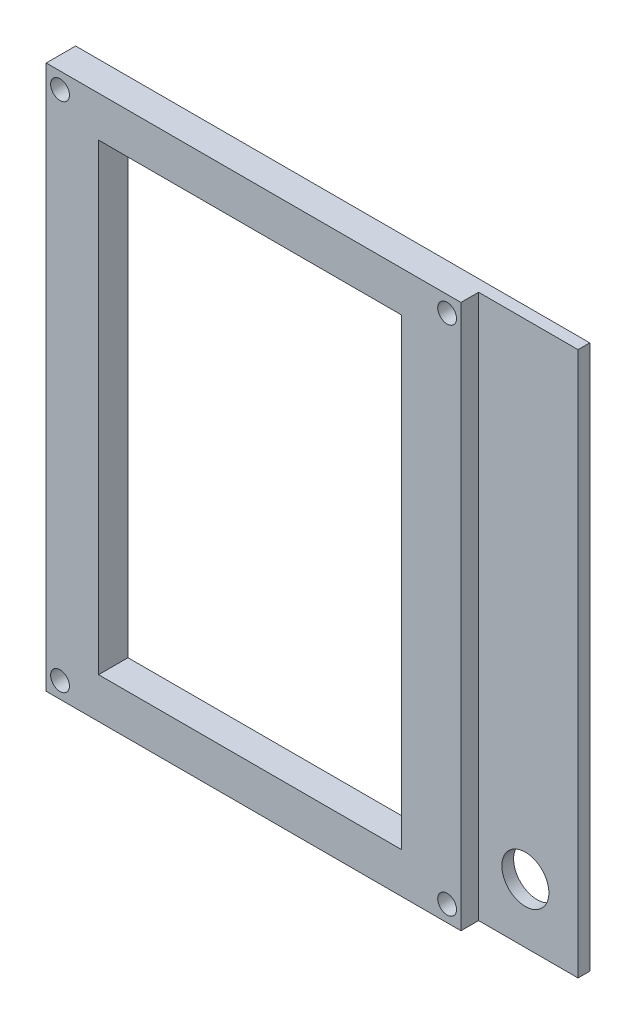
ISO-10303-21;
HEADER;
FILE_DESCRIPTION(('STEP AP214'),'2;1');
FILE_NAME('part.step','',(''),(''),'','','');
FILE_SCHEMA(('AUTOMOTIVE_DESIGN { 1 0 10303 214 1 1 1 1 }'));
ENDSEC;
DATA;
#1=APPLICATION_CONTEXT('core data for automotive mechanical design processes');
#2=APPLICATION_PROTOCOL_DEFINITION('international standard','automotive_design',2000,#1);
#3=PRODUCT_CONTEXT('',#1,'mechanical');
#4=PRODUCT('Part','Part','',(#3));
#5=PRODUCT_RELATED_PRODUCT_CATEGORY('part','',(#4));
#6=PRODUCT_DEFINITION_FORMATION('','',#4);
#7=PRODUCT_DEFINITION_CONTEXT('part definition',#1,'design');
#8=PRODUCT_DEFINITION('design','',#6,#7);
#9=PRODUCT_DEFINITION_SHAPE('','',#8);
#10=(LENGTH_UNIT() NAMED_UNIT(*) SI_UNIT(.MILLI.,.METRE.));
#11=(NAMED_UNIT(*) PLANE_ANGLE_UNIT() SI_UNIT($,.RADIAN.));
#12=(NAMED_UNIT(*) SI_UNIT($,.STERADIAN.) SOLID_ANGLE_UNIT());
#13=UNCERTAINTY_MEASURE_WITH_UNIT(LENGTH_MEASURE(1.E-05),#10,'distance_accuracy_value','');
#14=(GEOMETRIC_REPRESENTATION_CONTEXT(3) GLOBAL_UNCERTAINTY_ASSIGNED_CONTEXT((#13)) GLOBAL_UNIT_ASSIGNED_CONTEXT((#10,
#11,#12)) REPRESENTATION_CONTEXT('',''));
#15=CARTESIAN_POINT('',(0.,0.,0.));
#16=DIRECTION('',(0.,0.,1.));
#17=DIRECTION('',(1.,0.,0.));
#18=AXIS2_PLACEMENT_3D('',#15,#16,#17);
#19=CARTESIAN_POINT('',(74.75,97.2500000000001,87.6622974227393));
#20=DIRECTION('',(1.,0.,0.));
#21=DIRECTION('',(0.,0.,-1.));
#22=AXIS2_PLACEMENT_3D('',#19,#20,#21);
#23=PLANE('',#22);
#24=DIRECTION('',(0.,0.,1.));
#25=VECTOR('',#24,1.);
#26=CARTESIAN_POINT('',(74.75,4.75000000000003,87.6622974227393));
#27=LINE('',#26,#25);
#28=CARTESIAN_POINT('',(74.75,4.75000000000003,89.6622974227393));
#29=VERTEX_POINT('',#28);
#30=CARTESIAN_POINT('',(74.75,4.75000000000003,92.6622974227393));
#31=VERTEX_POINT('',#30);
#32=EDGE_CURVE('E55',#29,#31,#27,.T.);
#33=ORIENTED_EDGE('',*,*,#32,.F.);
#34=DIRECTION('',(0.,1.,0.));
#35=VECTOR('',#34,1.);
#36=CARTESIAN_POINT('',(74.75,97.2500000000001,89.6622974227393));
#37=LINE('',#36,#35);
#38=CARTESIAN_POINT('',(74.75,97.2500000000001,89.6622974227393));
#39=VERTEX_POINT('',#38);
#40=EDGE_CURVE('E50',#29,#39,#37,.T.);
#41=ORIENTED_EDGE('',*,*,#40,.T.);
#42=DIRECTION('',(0.,0.,1.));
#43=VECTOR('',#42,1.);
#44=CARTESIAN_POINT('',(74.75,97.2500000000001,87.6622974227393));
#45=LINE('',#44,#43);
#46=CARTESIAN_POINT('',(74.75,97.2500000000001,92.6622974227393));
#47=VERTEX_POINT('',#46);
#48=EDGE_CURVE('E116',#39,#47,#45,.T.);
#49=ORIENTED_EDGE('',*,*,#48,.T.);
#50=DIRECTION('',(0.,1.,0.));
#51=VECTOR('',#50,1.);
#52=CARTESIAN_POINT('',(74.75,97.2500000000001,92.6622974227393));
#53=LINE('',#52,#51);
#54=EDGE_CURVE('E186',#31,#47,#53,.T.);
#55=ORIENTED_EDGE('',*,*,#54,.F.);
#56=EDGE_LOOP('',(#33,#41,#49,#55));
#57=FACE_BOUND('',#56,.T.);
#58=ADVANCED_FACE('F33',(#57),#23,.T.);
#59=CARTESIAN_POINT('',(0.,0.,87.6622974227393));
#60=DIRECTION('',(0.,0.,-1.));
#61=DIRECTION('',(-1.,0.,0.));
#62=AXIS2_PLACEMENT_3D('',#59,#60,#61);
#63=PLANE('',#62);
#64=CARTESIAN_POINT('',(82.7,14.8,87.6622974227393));
#65=DIRECTION('',(0.,0.,-1.));
#66=DIRECTION('',(0.,1.,0.));
#67=AXIS2_PLACEMENT_3D('',#64,#65,#66);
#68=CIRCLE('',#67,4.);
#69=CARTESIAN_POINT('',(82.7,18.8000000000001,87.6622974227393));
#70=VERTEX_POINT('',#69);
#71=EDGE_CURVE('E414',#70,#70,#68,.T.);
#72=ORIENTED_EDGE('',*,*,#71,.F.);
#73=EDGE_LOOP('',(#72));
#74=FACE_BOUND('',#73,.T.);
#75=DIRECTION('',(1.,0.,0.));
#76=VECTOR('',#75,1.);
#77=CARTESIAN_POINT('',(13.15,11.65,87.6622974227393));
#78=LINE('',#77,#76);
#79=CARTESIAN_POINT('',(13.15,11.65,87.6622974227393));
#80=VERTEX_POINT('',#79);
#81=CARTESIAN_POINT('',(64.65,11.65,87.6622974227393));
#82=VERTEX_POINT('',#81);
#83=EDGE_CURVE('E144',#80,#82,#78,.T.);
#84=ORIENTED_EDGE('',*,*,#83,.T.);
#85=DIRECTION('',(0.,1.,0.));
#86=VECTOR('',#85,1.);
#87=CARTESIAN_POINT('',(64.65,90.3500000000001,87.6622974227393));
#88=LINE('',#87,#86);
#89=CARTESIAN_POINT('',(64.65,90.3500000000001,87.6622974227393));
#90=VERTEX_POINT('',#89);
#91=EDGE_CURVE('E148',#82,#90,#88,.T.);
#92=ORIENTED_EDGE('',*,*,#91,.T.);
#93=DIRECTION('',(-1.,0.,0.));
#94=VECTOR('',#93,1.);
#95=CARTESIAN_POINT('',(13.15,90.3500000000001,87.6622974227393));
#96=LINE('',#95,#94);
#97=CARTESIAN_POINT('',(13.15,90.3500000000001,87.6622974227393));
#98=VERTEX_POINT('',#97);
#99=EDGE_CURVE('E151',#90,#98,#96,.T.);
#100=ORIENTED_EDGE('',*,*,#99,.T.);
#101=DIRECTION('',(0.,-1.,0.));
#102=VECTOR('',#101,1.);
#103=CARTESIAN_POINT('',(13.15,90.3500000000001,87.6622974227393));
#104=LINE('',#103,#102);
#105=EDGE_CURVE('E141',#98,#80,#104,.T.);
#106=ORIENTED_EDGE('',*,*,#105,.T.);
#107=EDGE_LOOP('',(#84,#92,#100,#106));
#108=FACE_BOUND('',#107,.T.);
#109=DIRECTION('',(0.,-1.,0.));
#110=VECTOR('',#109,1.);
#111=CARTESIAN_POINT('',(91.65,97.2500000000001,87.6622974227393));
#112=LINE('',#111,#110);
#113=CARTESIAN_POINT('',(91.65,97.2500000000001,87.6622974227393));
#114=VERTEX_POINT('',#113);
#115=CARTESIAN_POINT('',(91.65,4.75000000000003,87.6622974227393));
#116=VERTEX_POINT('',#115);
#117=EDGE_CURVE('E120',#114,#116,#112,.T.);
#118=ORIENTED_EDGE('',*,*,#117,.T.);
#119=DIRECTION('',(1.,0.,0.));
#120=VECTOR('',#119,1.);
#121=CARTESIAN_POINT('',(4.24999999999998,4.75000000000003,87.6622974227393));
#122=LINE('',#121,#120);
#123=CARTESIAN_POINT('',(4.24999999999998,4.75000000000003,87.6622974227393));
#124=VERTEX_POINT('',#123);
#125=EDGE_CURVE('E175',#124,#116,#122,.T.);
#126=ORIENTED_EDGE('',*,*,#125,.F.);
#127=DIRECTION('',(0.,-1.,0.));
#128=VECTOR('',#127,1.);
#129=CARTESIAN_POINT('',(4.24999999999998,97.2500000000001,87.6622974227393));
#130=LINE('',#129,#128);
#131=CARTESIAN_POINT('',(4.24999999999998,97.2500000000001,87.6622974227393));
#132=VERTEX_POINT('',#131);
#133=EDGE_CURVE('E173',#132,#124,#130,.T.);
#134=ORIENTED_EDGE('',*,*,#133,.F.);
#135=DIRECTION('',(-1.,0.,0.));
#136=VECTOR('',#135,1.);
#137=CARTESIAN_POINT('',(4.24999999999998,97.2500000000001,87.6622974227393));
#138=LINE('',#137,#136);
#139=EDGE_CURVE('E178',#114,#132,#138,.T.);
#140=ORIENTED_EDGE('',*,*,#139,.F.);
#141=EDGE_LOOP('',(#118,#126,#134,#140));
#142=FACE_BOUND('',#141,.T.);
#143=CARTESIAN_POINT('',(6.59999999999997,7.50000000000007,87.6622974227393));
#144=DIRECTION('',(0.,0.,-1.));
#145=DIRECTION('',(0.,1.,0.));
#146=AXIS2_PLACEMENT_3D('',#143,#144,#145);
#147=CIRCLE('',#146,1.6);
#148=CARTESIAN_POINT('',(6.59999999999997,9.10000000000007,87.6622974227393));
#149=VERTEX_POINT('',#148);
#150=EDGE_CURVE('E11',#149,#149,#147,.T.);
#151=ORIENTED_EDGE('',*,*,#150,.F.);
#152=EDGE_LOOP('',(#151));
#153=FACE_BOUND('',#152,.T.);
#154=CARTESIAN_POINT('',(6.59999999999999,94.5000000000001,87.6622974227393));
#155=DIRECTION('',(0.,0.,-1.));
#156=DIRECTION('',(0.,1.,0.));
#157=AXIS2_PLACEMENT_3D('',#154,#155,#156);
#158=CIRCLE('',#157,1.60000000000001);
#159=CARTESIAN_POINT('',(6.59999999999999,96.1000000000001,87.6622974227393));
#160=VERTEX_POINT('',#159);
#161=EDGE_CURVE('E203',#160,#160,#158,.T.);
#162=ORIENTED_EDGE('',*,*,#161,.F.);
#163=EDGE_LOOP('',(#162));
#164=FACE_BOUND('',#163,.T.);
#165=CARTESIAN_POINT('',(72.4,7.50000000000004,87.6622974227393));
#166=DIRECTION('',(0.,0.,-1.));
#167=DIRECTION('',(0.,1.,0.));
#168=AXIS2_PLACEMENT_3D('',#165,#166,#167);
#169=CIRCLE('',#168,1.6);
#170=CARTESIAN_POINT('',(72.4,9.10000000000005,87.6622974227393));
#171=VERTEX_POINT('',#170);
#172=EDGE_CURVE('E209',#171,#171,#169,.T.);
#173=ORIENTED_EDGE('',*,*,#172,.F.);
#174=EDGE_LOOP('',(#173));
#175=FACE_BOUND('',#174,.T.);
#176=CARTESIAN_POINT('',(72.4,94.5000000000001,87.6622974227393));
#177=DIRECTION('',(0.,0.,-1.));
#178=DIRECTION('',(0.,1.,0.));
#179=AXIS2_PLACEMENT_3D('',#176,#177,#178);
#180=CIRCLE('',#179,1.60000000000001);
#181=CARTESIAN_POINT('',(72.4,96.1000000000001,87.6622974227393));
#182=VERTEX_POINT('',#181);
#183=EDGE_CURVE('E197',#182,#182,#180,.T.);
#184=ORIENTED_EDGE('',*,*,#183,.F.);
#185=EDGE_LOOP('',(#184));
#186=FACE_BOUND('',#185,.T.);
#187=ADVANCED_FACE('F230',(#74,#108,#142,#153,#164,#175,#186),#63,.T.);
#188=CARTESIAN_POINT('',(0.,0.,92.6622974227393));
#189=DIRECTION('',(0.,0.,-1.));
#190=DIRECTION('',(-1.,0.,0.));
#191=AXIS2_PLACEMENT_3D('',#188,#189,#190);
#192=PLANE('',#191);
#193=DIRECTION('',(1.,0.,0.));
#194=VECTOR('',#193,1.);
#195=CARTESIAN_POINT('',(13.15,11.65,92.6622974227393));
#196=LINE('',#195,#194);
#197=CARTESIAN_POINT('',(13.15,11.65,92.6622974227393));
#198=VERTEX_POINT('',#197);
#199=CARTESIAN_POINT('',(64.65,11.65,92.6622974227393));
#200=VERTEX_POINT('',#199);
#201=EDGE_CURVE('E156',#198,#200,#196,.T.);
#202=ORIENTED_EDGE('',*,*,#201,.F.);
#203=DIRECTION('',(0.,-1.,0.));
#204=VECTOR('',#203,1.);
#205=CARTESIAN_POINT('',(13.15,90.3500000000001,92.6622974227393));
#206=LINE('',#205,#204);
#207=CARTESIAN_POINT('',(13.15,90.3500000000001,92.6622974227393));
#208=VERTEX_POINT('',#207);
#209=EDGE_CURVE('E140',#208,#198,#206,.T.);
#210=ORIENTED_EDGE('',*,*,#209,.F.);
#211=DIRECTION('',(-1.,0.,0.));
#212=VECTOR('',#211,1.);
#213=CARTESIAN_POINT('',(13.15,90.3500000000001,92.6622974227393));
#214=LINE('',#213,#212);
#215=CARTESIAN_POINT('',(64.65,90.3500000000001,92.6622974227393));
#216=VERTEX_POINT('',#215);
#217=EDGE_CURVE('E145',#216,#208,#214,.T.);
#218=ORIENTED_EDGE('',*,*,#217,.F.);
#219=DIRECTION('',(0.,1.,0.));
#220=VECTOR('',#219,1.);
#221=CARTESIAN_POINT('',(64.65,90.3500000000001,92.6622974227393));
#222=LINE('',#221,#220);
#223=EDGE_CURVE('E159',#200,#216,#222,.T.);
#224=ORIENTED_EDGE('',*,*,#223,.F.);
#225=EDGE_LOOP('',(#202,#210,#218,#224));
#226=FACE_BOUND('',#225,.T.);
#227=CARTESIAN_POINT('',(6.59999999999997,7.50000000000007,92.6622974227393));
#228=DIRECTION('',(0.,0.,-1.));
#229=DIRECTION('',(0.,1.,0.));
#230=AXIS2_PLACEMENT_3D('',#227,#228,#229);
#231=CIRCLE('',#230,1.6);
#232=CARTESIAN_POINT('',(6.59999999999997,9.10000000000007,92.6622974227393));
#233=VERTEX_POINT('',#232);
#234=EDGE_CURVE('E42',#233,#233,#231,.T.);
#235=ORIENTED_EDGE('',*,*,#234,.T.);
#236=EDGE_LOOP('',(#235));
#237=FACE_BOUND('',#236,.T.);
#238=CARTESIAN_POINT('',(72.4,7.50000000000004,92.6622974227393));
#239=DIRECTION('',(0.,0.,-1.));
#240=DIRECTION('',(0.,1.,0.));
#241=AXIS2_PLACEMENT_3D('',#238,#239,#240);
#242=CIRCLE('',#241,1.6);
#243=CARTESIAN_POINT('',(72.4,9.10000000000005,92.6622974227393));
#244=VERTEX_POINT('',#243);
#245=EDGE_CURVE('E206',#244,#244,#242,.T.);
#246=ORIENTED_EDGE('',*,*,#245,.T.);
#247=EDGE_LOOP('',(#246));
#248=FACE_BOUND('',#247,.T.);
#249=CARTESIAN_POINT('',(6.59999999999999,94.5000000000001,92.6622974227393));
#250=DIRECTION('',(0.,0.,-1.));
#251=DIRECTION('',(0.,1.,0.));
#252=AXIS2_PLACEMENT_3D('',#249,#250,#251);
#253=CIRCLE('',#252,1.60000000000001);
#254=CARTESIAN_POINT('',(6.59999999999999,96.1000000000001,92.6622974227393));
#255=VERTEX_POINT('',#254);
#256=EDGE_CURVE('E200',#255,#255,#253,.T.);
#257=ORIENTED_EDGE('',*,*,#256,.T.);
#258=EDGE_LOOP('',(#257));
#259=FACE_BOUND('',#258,.T.);
#260=CARTESIAN_POINT('',(72.4,94.5000000000001,92.6622974227393));
#261=DIRECTION('',(0.,0.,-1.));
#262=DIRECTION('',(0.,1.,0.));
#263=AXIS2_PLACEMENT_3D('',#260,#261,#262);
#264=CIRCLE('',#263,1.60000000000001);
#265=CARTESIAN_POINT('',(72.4,96.1000000000001,92.6622974227393));
#266=VERTEX_POINT('',#265);
#267=EDGE_CURVE('E193',#266,#266,#264,.T.);
#268=ORIENTED_EDGE('',*,*,#267,.T.);
#269=EDGE_LOOP('',(#268));
#270=FACE_BOUND('',#269,.T.);
#271=DIRECTION('',(0.,-1.,0.));
#272=VECTOR('',#271,1.);
#273=CARTESIAN_POINT('',(4.24999999999998,97.2500000000001,92.6622974227393));
#274=LINE('',#273,#272);
#275=CARTESIAN_POINT('',(4.24999999999998,97.2500000000001,92.6622974227393));
#276=VERTEX_POINT('',#275);
#277=CARTESIAN_POINT('',(4.24999999999998,4.75000000000003,92.6622974227393));
#278=VERTEX_POINT('',#277);
#279=EDGE_CURVE('E166',#276,#278,#274,.T.);
#280=ORIENTED_EDGE('',*,*,#279,.T.);
#281=DIRECTION('',(1.,0.,0.));
#282=VECTOR('',#281,1.);
#283=CARTESIAN_POINT('',(4.24999999999998,4.75000000000003,92.6622974227393));
#284=LINE('',#283,#282);
#285=EDGE_CURVE('E183',#278,#31,#284,.T.);
#286=ORIENTED_EDGE('',*,*,#285,.T.);
#287=ORIENTED_EDGE('',*,*,#54,.T.);
#288=DIRECTION('',(-1.,0.,0.));
#289=VECTOR('',#288,1.);
#290=CARTESIAN_POINT('',(4.24999999999998,97.2500000000001,92.6622974227393));
#291=LINE('',#290,#289);
#292=EDGE_CURVE('E176',#47,#276,#291,.T.);
#293=ORIENTED_EDGE('',*,*,#292,.T.);
#294=EDGE_LOOP('',(#280,#286,#287,#293));
#295=FACE_BOUND('',#294,.T.);
#296=ADVANCED_FACE('F35',(#226,#237,#248,#259,#270,#295),#192,.F.);
#297=CARTESIAN_POINT('',(6.59999999999997,7.50000000000007,87.6622974227393));
#298=DIRECTION('',(0.,0.,1.));
#299=DIRECTION('',(0.,-1.,0.));
#300=AXIS2_PLACEMENT_3D('',#297,#298,#299);
#301=CYLINDRICAL_SURFACE('',#300,1.6);
#302=ORIENTED_EDGE('',*,*,#150,.T.);
#303=EDGE_LOOP('',(#302));
#304=FACE_BOUND('',#303,.T.);
#305=ORIENTED_EDGE('',*,*,#234,.F.);
#306=EDGE_LOOP('',(#305));
#307=FACE_BOUND('',#306,.T.);
#308=ADVANCED_FACE('F218',(#304,#307),#301,.F.);
#309=CARTESIAN_POINT('',(72.4,7.50000000000004,87.6622974227393));
#310=DIRECTION('',(0.,0.,1.));
#311=DIRECTION('',(0.,-1.,0.));
#312=AXIS2_PLACEMENT_3D('',#309,#310,#311);
#313=CYLINDRICAL_SURFACE('',#312,1.6);
#314=ORIENTED_EDGE('',*,*,#172,.T.);
#315=EDGE_LOOP('',(#314));
#316=FACE_BOUND('',#315,.T.);
#317=ORIENTED_EDGE('',*,*,#245,.F.);
#318=EDGE_LOOP('',(#317));
#319=FACE_BOUND('',#318,.T.);
#320=ADVANCED_FACE('F220',(#316,#319),#313,.F.);
#321=CARTESIAN_POINT('',(6.59999999999999,94.5000000000001,87.6622974227393));
#322=DIRECTION('',(0.,0.,1.));
#323=DIRECTION('',(0.,-1.,0.));
#324=AXIS2_PLACEMENT_3D('',#321,#322,#323);
#325=CYLINDRICAL_SURFACE('',#324,1.60000000000001);
#326=ORIENTED_EDGE('',*,*,#161,.T.);
#327=EDGE_LOOP('',(#326));
#328=FACE_BOUND('',#327,.T.);
#329=ORIENTED_EDGE('',*,*,#256,.F.);
#330=EDGE_LOOP('',(#329));
#331=FACE_BOUND('',#330,.T.);
#332=ADVANCED_FACE('F227',(#328,#331),#325,.F.);
#333=CARTESIAN_POINT('',(72.4,94.5000000000001,87.6622974227393));
#334=DIRECTION('',(0.,0.,1.));
#335=DIRECTION('',(0.,-1.,0.));
#336=AXIS2_PLACEMENT_3D('',#333,#334,#335);
#337=CYLINDRICAL_SURFACE('',#336,1.60000000000001);
#338=ORIENTED_EDGE('',*,*,#183,.T.);
#339=EDGE_LOOP('',(#338));
#340=FACE_BOUND('',#339,.T.);
#341=ORIENTED_EDGE('',*,*,#267,.F.);
#342=EDGE_LOOP('',(#341));
#343=FACE_BOUND('',#342,.T.);
#344=ADVANCED_FACE('F249',(#340,#343),#337,.F.);
#345=CARTESIAN_POINT('',(4.24999999999998,97.2500000000001,87.6622974227393));
#346=DIRECTION('',(-1.,0.,0.));
#347=DIRECTION('',(0.,-1.,0.));
#348=AXIS2_PLACEMENT_3D('',#345,#346,#347);
#349=PLANE('',#348);
#350=ORIENTED_EDGE('',*,*,#279,.F.);
#351=DIRECTION('',(0.,0.,1.));
#352=VECTOR('',#351,1.);
#353=CARTESIAN_POINT('',(4.24999999999998,97.2500000000001,87.6622974227393));
#354=LINE('',#353,#352);
#355=EDGE_CURVE('E191',#132,#276,#354,.T.);
#356=ORIENTED_EDGE('',*,*,#355,.F.);
#357=ORIENTED_EDGE('',*,*,#133,.T.);
#358=DIRECTION('',(0.,0.,1.));
#359=VECTOR('',#358,1.);
#360=CARTESIAN_POINT('',(4.24999999999998,4.75000000000003,87.6622974227393));
#361=LINE('',#360,#359);
#362=EDGE_CURVE('E180',#124,#278,#361,.T.);
#363=ORIENTED_EDGE('',*,*,#362,.T.);
#364=EDGE_LOOP('',(#350,#356,#357,#363));
#365=FACE_BOUND('',#364,.T.);
#366=ADVANCED_FACE('F246',(#365),#349,.T.);
#367=CARTESIAN_POINT('',(4.24999999999998,97.2500000000001,87.6622974227393));
#368=DIRECTION('',(0.,1.,0.));
#369=DIRECTION('',(0.,0.,1.));
#370=AXIS2_PLACEMENT_3D('',#367,#368,#369);
#371=PLANE('',#370);
#372=ORIENTED_EDGE('',*,*,#139,.T.);
#373=ORIENTED_EDGE('',*,*,#355,.T.);
#374=ORIENTED_EDGE('',*,*,#292,.F.);
#375=ORIENTED_EDGE('',*,*,#48,.F.);
#376=DIRECTION('',(1.,0.,0.));
#377=VECTOR('',#376,1.);
#378=CARTESIAN_POINT('',(64.65,97.2500000000001,89.6622974227393));
#379=LINE('',#378,#377);
#380=CARTESIAN_POINT('',(91.65,97.2500000000001,89.6622974227393));
#381=VERTEX_POINT('',#380);
#382=EDGE_CURVE('E110',#39,#381,#379,.T.);
#383=ORIENTED_EDGE('',*,*,#382,.T.);
#384=DIRECTION('',(0.,0.,-1.));
#385=VECTOR('',#384,1.);
#386=CARTESIAN_POINT('',(91.65,97.2500000000001,89.6622974227393));
#387=LINE('',#386,#385);
#388=EDGE_CURVE('E113',#381,#114,#387,.T.);
#389=ORIENTED_EDGE('',*,*,#388,.T.);
#390=EDGE_LOOP('',(#372,#373,#374,#375,#383,#389));
#391=FACE_BOUND('',#390,.T.);
#392=ADVANCED_FACE('F112',(#391),#371,.T.);
#393=CARTESIAN_POINT('',(4.24999999999998,4.75000000000003,87.6622974227393));
#394=DIRECTION('',(0.,-1.,0.));
#395=DIRECTION('',(0.,0.,-1.));
#396=AXIS2_PLACEMENT_3D('',#393,#394,#395);
#397=PLANE('',#396);
#398=ORIENTED_EDGE('',*,*,#125,.T.);
#399=DIRECTION('',(0.,0.,-1.));
#400=VECTOR('',#399,1.);
#401=CARTESIAN_POINT('',(91.65,4.75000000000003,89.6622974227393));
#402=LINE('',#401,#400);
#403=CARTESIAN_POINT('',(91.65,4.75000000000003,89.6622974227393));
#404=VERTEX_POINT('',#403);
#405=EDGE_CURVE('E127',#404,#116,#402,.T.);
#406=ORIENTED_EDGE('',*,*,#405,.F.);
#407=DIRECTION('',(-1.,0.,0.));
#408=VECTOR('',#407,1.);
#409=CARTESIAN_POINT('',(64.65,4.75000000000003,89.6622974227393));
#410=LINE('',#409,#408);
#411=EDGE_CURVE('E128',#404,#29,#410,.T.);
#412=ORIENTED_EDGE('',*,*,#411,.T.);
#413=ORIENTED_EDGE('',*,*,#32,.T.);
#414=ORIENTED_EDGE('',*,*,#285,.F.);
#415=ORIENTED_EDGE('',*,*,#362,.F.);
#416=EDGE_LOOP('',(#398,#406,#412,#413,#414,#415));
#417=FACE_BOUND('',#416,.T.);
#418=ADVANCED_FACE('F241',(#417),#397,.T.);
#419=CARTESIAN_POINT('',(13.15,90.3500000000001,87.6622974227393));
#420=DIRECTION('',(-1.,0.,0.));
#421=DIRECTION('',(0.,-1.,0.));
#422=AXIS2_PLACEMENT_3D('',#419,#420,#421);
#423=PLANE('',#422);
#424=ORIENTED_EDGE('',*,*,#209,.T.);
#425=DIRECTION('',(0.,0.,1.));
#426=VECTOR('',#425,1.);
#427=CARTESIAN_POINT('',(13.15,11.65,87.6622974227393));
#428=LINE('',#427,#426);
#429=EDGE_CURVE('E154',#80,#198,#428,.T.);
#430=ORIENTED_EDGE('',*,*,#429,.F.);
#431=ORIENTED_EDGE('',*,*,#105,.F.);
#432=DIRECTION('',(0.,0.,1.));
#433=VECTOR('',#432,1.);
#434=CARTESIAN_POINT('',(13.15,90.3500000000001,87.6622974227393));
#435=LINE('',#434,#433);
#436=EDGE_CURVE('E164',#98,#208,#435,.T.);
#437=ORIENTED_EDGE('',*,*,#436,.T.);
#438=EDGE_LOOP('',(#424,#430,#431,#437));
#439=FACE_BOUND('',#438,.T.);
#440=ADVANCED_FACE('F244',(#439),#423,.F.);
#441=CARTESIAN_POINT('',(13.15,90.3500000000001,87.6622974227393));
#442=DIRECTION('',(0.,1.,0.));
#443=DIRECTION('',(0.,0.,1.));
#444=AXIS2_PLACEMENT_3D('',#441,#442,#443);
#445=PLANE('',#444);
#446=ORIENTED_EDGE('',*,*,#217,.T.);
#447=ORIENTED_EDGE('',*,*,#436,.F.);
#448=ORIENTED_EDGE('',*,*,#99,.F.);
#449=DIRECTION('',(0.,0.,1.));
#450=VECTOR('',#449,1.);
#451=CARTESIAN_POINT('',(64.65,90.3500000000001,87.6622974227393));
#452=LINE('',#451,#450);
#453=EDGE_CURVE('E167',#90,#216,#452,.T.);
#454=ORIENTED_EDGE('',*,*,#453,.T.);
#455=EDGE_LOOP('',(#446,#447,#448,#454));
#456=FACE_BOUND('',#455,.T.);
#457=ADVANCED_FACE('F309',(#456),#445,.F.);
#458=CARTESIAN_POINT('',(64.65,90.3500000000001,87.6622974227393));
#459=DIRECTION('',(1.,0.,0.));
#460=DIRECTION('',(0.,0.,-1.));
#461=AXIS2_PLACEMENT_3D('',#458,#459,#460);
#462=PLANE('',#461);
#463=DIRECTION('',(0.,0.,1.));
#464=VECTOR('',#463,1.);
#465=CARTESIAN_POINT('',(64.65,11.65,87.6622974227393));
#466=LINE('',#465,#464);
#467=EDGE_CURVE('E169',#82,#200,#466,.T.);
#468=ORIENTED_EDGE('',*,*,#467,.T.);
#469=ORIENTED_EDGE('',*,*,#223,.T.);
#470=ORIENTED_EDGE('',*,*,#453,.F.);
#471=ORIENTED_EDGE('',*,*,#91,.F.);
#472=EDGE_LOOP('',(#468,#469,#470,#471));
#473=FACE_BOUND('',#472,.T.);
#474=ADVANCED_FACE('F315',(#473),#462,.F.);
#475=CARTESIAN_POINT('',(13.15,11.65,87.6622974227393));
#476=DIRECTION('',(0.,-1.,0.));
#477=DIRECTION('',(0.,0.,-1.));
#478=AXIS2_PLACEMENT_3D('',#475,#476,#477);
#479=PLANE('',#478);
#480=ORIENTED_EDGE('',*,*,#201,.T.);
#481=ORIENTED_EDGE('',*,*,#467,.F.);
#482=ORIENTED_EDGE('',*,*,#83,.F.);
#483=ORIENTED_EDGE('',*,*,#429,.T.);
#484=EDGE_LOOP('',(#480,#481,#482,#483));
#485=FACE_BOUND('',#484,.T.);
#486=ADVANCED_FACE('F323',(#485),#479,.F.);
#487=CARTESIAN_POINT('',(91.65,97.2500000000001,89.6622974227393));
#488=DIRECTION('',(1.,0.,0.));
#489=DIRECTION('',(0.,1.,0.));
#490=AXIS2_PLACEMENT_3D('',#487,#488,#489);
#491=PLANE('',#490);
#492=ORIENTED_EDGE('',*,*,#117,.F.);
#493=ORIENTED_EDGE('',*,*,#388,.F.);
#494=DIRECTION('',(0.,-1.,0.));
#495=VECTOR('',#494,1.);
#496=CARTESIAN_POINT('',(91.65,97.2500000000001,89.6622974227393));
#497=LINE('',#496,#495);
#498=EDGE_CURVE('E119',#381,#404,#497,.T.);
#499=ORIENTED_EDGE('',*,*,#498,.T.);
#500=ORIENTED_EDGE('',*,*,#405,.T.);
#501=EDGE_LOOP('',(#492,#493,#499,#500));
#502=FACE_BOUND('',#501,.T.);
#503=ADVANCED_FACE('F124',(#502),#491,.T.);
#504=CARTESIAN_POINT('',(0.,0.,89.6622974227393));
#505=DIRECTION('',(0.,0.,-1.));
#506=DIRECTION('',(0.,1.,0.));
#507=AXIS2_PLACEMENT_3D('',#504,#505,#506);
#508=PLANE('',#507);
#509=CARTESIAN_POINT('',(82.7,14.8,89.6622974227393));
#510=DIRECTION('',(0.,0.,-1.));
#511=DIRECTION('',(0.,1.,0.));
#512=AXIS2_PLACEMENT_3D('',#509,#510,#511);
#513=CIRCLE('',#512,4.);
#514=CARTESIAN_POINT('',(82.7,18.8000000000001,89.6622974227393));
#515=VERTEX_POINT('',#514);
#516=EDGE_CURVE('E37',#515,#515,#513,.T.);
#517=ORIENTED_EDGE('',*,*,#516,.T.);
#518=EDGE_LOOP('',(#517));
#519=FACE_BOUND('',#518,.T.);
#520=ORIENTED_EDGE('',*,*,#40,.F.);
#521=ORIENTED_EDGE('',*,*,#411,.F.);
#522=ORIENTED_EDGE('',*,*,#498,.F.);
#523=ORIENTED_EDGE('',*,*,#382,.F.);
#524=EDGE_LOOP('',(#520,#521,#522,#523));
#525=FACE_BOUND('',#524,.T.);
#526=ADVANCED_FACE('F131',(#519,#525),#508,.F.);
#527=CARTESIAN_POINT('',(82.7,14.8,92.6622974227393));
#528=DIRECTION('',(0.,0.,-1.));
#529=DIRECTION('',(0.,1.,0.));
#530=AXIS2_PLACEMENT_3D('',#527,#528,#529);
#531=CYLINDRICAL_SURFACE('',#530,4.);
#532=ORIENTED_EDGE('',*,*,#71,.T.);
#533=EDGE_LOOP('',(#532));
#534=FACE_BOUND('',#533,.T.);
#535=ORIENTED_EDGE('',*,*,#516,.F.);
#536=EDGE_LOOP('',(#535));
#537=FACE_BOUND('',#536,.T.);
#538=ADVANCED_FACE('F345',(#534,#537),#531,.F.);
#539=CLOSED_SHELL('',(#58,#187,#296,#308,#320,#332,#344,#366,#392,#418,#440,#457,#474,#486,#503,
#526,#538));
#540=MANIFOLD_SOLID_BREP('B2',#539);
#541=ADVANCED_BREP_SHAPE_REPRESENTATION('',(#18,#540),#14);
#542=SHAPE_DEFINITION_REPRESENTATION(#9,#541);
ENDSEC;
END-ISO-10303-21;
